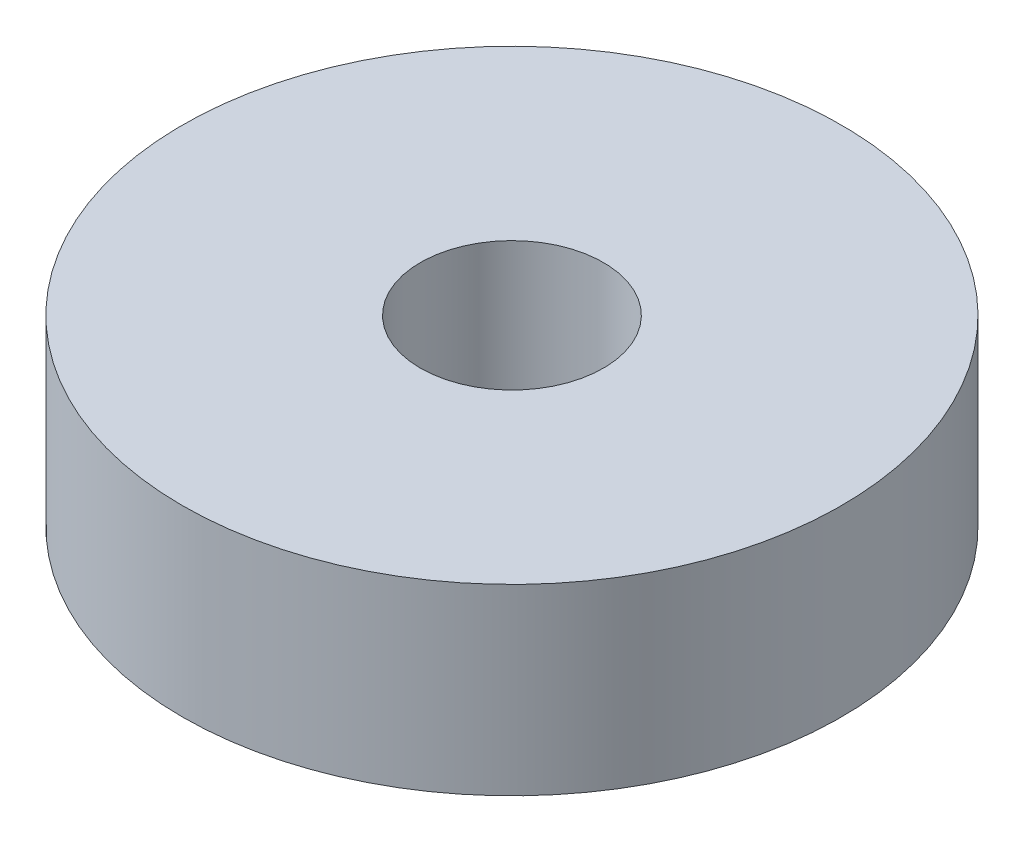
ISO-10303-21;
HEADER;
FILE_DESCRIPTION(('STEP AP214'),'2;1');
FILE_NAME('part.step','',(''),(''),'','','');
FILE_SCHEMA(('AUTOMOTIVE_DESIGN { 1 0 10303 214 1 1 1 1 }'));
ENDSEC;
DATA;
#1=APPLICATION_CONTEXT('core data for automotive mechanical design processes');
#2=APPLICATION_PROTOCOL_DEFINITION('international standard','automotive_design',2000,#1);
#3=PRODUCT_CONTEXT('',#1,'mechanical');
#4=PRODUCT('Part','Part','',(#3));
#5=PRODUCT_RELATED_PRODUCT_CATEGORY('part','',(#4));
#6=PRODUCT_DEFINITION_FORMATION('','',#4);
#7=PRODUCT_DEFINITION_CONTEXT('part definition',#1,'design');
#8=PRODUCT_DEFINITION('design','',#6,#7);
#9=PRODUCT_DEFINITION_SHAPE('','',#8);
#10=(LENGTH_UNIT() NAMED_UNIT(*) SI_UNIT(.MILLI.,.METRE.));
#11=(NAMED_UNIT(*) PLANE_ANGLE_UNIT() SI_UNIT($,.RADIAN.));
#12=(NAMED_UNIT(*) SI_UNIT($,.STERADIAN.) SOLID_ANGLE_UNIT());
#13=UNCERTAINTY_MEASURE_WITH_UNIT(LENGTH_MEASURE(1.E-05),#10,'distance_accuracy_value','');
#14=(GEOMETRIC_REPRESENTATION_CONTEXT(3) GLOBAL_UNCERTAINTY_ASSIGNED_CONTEXT((#13)) GLOBAL_UNIT_ASSIGNED_CONTEXT((#10,
#11,#12)) REPRESENTATION_CONTEXT('',''));
#15=CARTESIAN_POINT('',(0.,0.,0.));
#16=DIRECTION('',(0.,0.,1.));
#17=DIRECTION('',(1.,0.,0.));
#18=AXIS2_PLACEMENT_3D('',#15,#16,#17);
#19=CARTESIAN_POINT('',(0.,5.,0.));
#20=DIRECTION('',(0.,1.,0.));
#21=DIRECTION('',(0.,0.,1.));
#22=AXIS2_PLACEMENT_3D('',#19,#20,#21);
#23=PLANE('',#22);
#24=CARTESIAN_POINT('',(0.,5.,0.));
#25=DIRECTION('',(0.,1.,0.));
#26=DIRECTION('',(0.,0.,1.));
#27=AXIS2_PLACEMENT_3D('',#24,#25,#26);
#28=CIRCLE('',#27,9.);
#29=CARTESIAN_POINT('',(0.,5.,9.));
#30=VERTEX_POINT('',#29);
#31=EDGE_CURVE('E10',#30,#30,#28,.T.);
#32=ORIENTED_EDGE('',*,*,#31,.T.);
#33=EDGE_LOOP('',(#32));
#34=FACE_BOUND('',#33,.T.);
#35=CARTESIAN_POINT('',(0.,5.,0.));
#36=DIRECTION('',(0.,1.,0.));
#37=DIRECTION('',(0.,0.,1.));
#38=AXIS2_PLACEMENT_3D('',#35,#36,#37);
#39=CIRCLE('',#38,2.5);
#40=CARTESIAN_POINT('',(0.,5.,2.5));
#41=VERTEX_POINT('',#40);
#42=EDGE_CURVE('E50',#41,#41,#39,.T.);
#43=ORIENTED_EDGE('',*,*,#42,.F.);
#44=EDGE_LOOP('',(#43));
#45=FACE_BOUND('',#44,.T.);
#46=ADVANCED_FACE('F37',(#34,#45),#23,.T.);
#47=CARTESIAN_POINT('',(0.,0.,0.));
#48=DIRECTION('',(0.,1.,0.));
#49=DIRECTION('',(0.,0.,1.));
#50=AXIS2_PLACEMENT_3D('',#47,#48,#49);
#51=PLANE('',#50);
#52=CARTESIAN_POINT('',(0.,0.,0.));
#53=DIRECTION('',(0.,1.,0.));
#54=DIRECTION('',(0.,0.,1.));
#55=AXIS2_PLACEMENT_3D('',#52,#53,#54);
#56=CIRCLE('',#55,9.);
#57=CARTESIAN_POINT('',(0.,0.,9.));
#58=VERTEX_POINT('',#57);
#59=EDGE_CURVE('E41',#58,#58,#56,.T.);
#60=ORIENTED_EDGE('',*,*,#59,.F.);
#61=EDGE_LOOP('',(#60));
#62=FACE_BOUND('',#61,.T.);
#63=CARTESIAN_POINT('',(0.,0.,0.));
#64=DIRECTION('',(0.,1.,0.));
#65=DIRECTION('',(0.,0.,1.));
#66=AXIS2_PLACEMENT_3D('',#63,#64,#65);
#67=CIRCLE('',#66,2.5);
#68=CARTESIAN_POINT('',(0.,0.,2.5));
#69=VERTEX_POINT('',#68);
#70=EDGE_CURVE('E52',#69,#69,#67,.T.);
#71=ORIENTED_EDGE('',*,*,#70,.T.);
#72=EDGE_LOOP('',(#71));
#73=FACE_BOUND('',#72,.T.);
#74=ADVANCED_FACE('F64',(#62,#73),#51,.F.);
#75=CARTESIAN_POINT('',(0.,5.,0.));
#76=DIRECTION('',(0.,-1.,0.));
#77=DIRECTION('',(0.,0.,-1.));
#78=AXIS2_PLACEMENT_3D('',#75,#76,#77);
#79=CYLINDRICAL_SURFACE('',#78,9.);
#80=ORIENTED_EDGE('',*,*,#31,.F.);
#81=EDGE_LOOP('',(#80));
#82=FACE_BOUND('',#81,.T.);
#83=ORIENTED_EDGE('',*,*,#59,.T.);
#84=EDGE_LOOP('',(#83));
#85=FACE_BOUND('',#84,.T.);
#86=ADVANCED_FACE('F39',(#82,#85),#79,.T.);
#87=CARTESIAN_POINT('',(0.,5.,0.));
#88=DIRECTION('',(0.,-1.,0.));
#89=DIRECTION('',(0.,0.,-1.));
#90=AXIS2_PLACEMENT_3D('',#87,#88,#89);
#91=CYLINDRICAL_SURFACE('',#90,2.5);
#92=ORIENTED_EDGE('',*,*,#42,.T.);
#93=EDGE_LOOP('',(#92));
#94=FACE_BOUND('',#93,.T.);
#95=ORIENTED_EDGE('',*,*,#70,.F.);
#96=EDGE_LOOP('',(#95));
#97=FACE_BOUND('',#96,.T.);
#98=ADVANCED_FACE('F60',(#94,#97),#91,.F.);
#99=CLOSED_SHELL('',(#46,#74,#86,#98));
#100=MANIFOLD_SOLID_BREP('B2',#99);
#101=ADVANCED_BREP_SHAPE_REPRESENTATION('',(#18,#100),#14);
#102=SHAPE_DEFINITION_REPRESENTATION(#9,#101);
ENDSEC;
END-ISO-10303-21;
